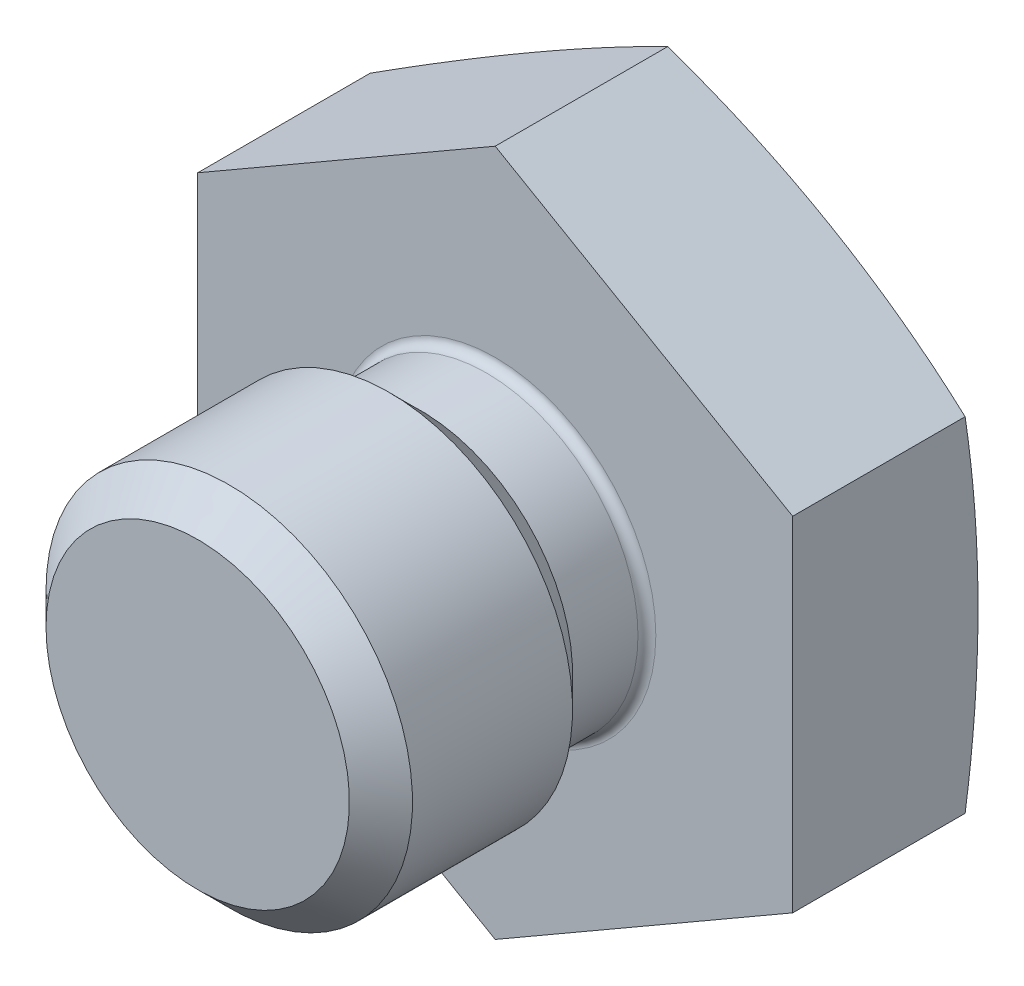
ISO-10303-21;
HEADER;
FILE_DESCRIPTION(('STEP AP214'),'2;1');
FILE_NAME('part.step','',(''),(''),'','','');
FILE_SCHEMA(('AUTOMOTIVE_DESIGN { 1 0 10303 214 1 1 1 1 }'));
ENDSEC;
DATA;
#1=APPLICATION_CONTEXT('core data for automotive mechanical design processes');
#2=APPLICATION_PROTOCOL_DEFINITION('international standard','automotive_design',2000,#1);
#3=PRODUCT_CONTEXT('',#1,'mechanical');
#4=PRODUCT('Part','Part','',(#3));
#5=PRODUCT_RELATED_PRODUCT_CATEGORY('part','',(#4));
#6=PRODUCT_DEFINITION_FORMATION('','',#4);
#7=PRODUCT_DEFINITION_CONTEXT('part definition',#1,'design');
#8=PRODUCT_DEFINITION('design','',#6,#7);
#9=PRODUCT_DEFINITION_SHAPE('','',#8);
#10=(LENGTH_UNIT() NAMED_UNIT(*) SI_UNIT(.MILLI.,.METRE.));
#11=(NAMED_UNIT(*) PLANE_ANGLE_UNIT() SI_UNIT($,.RADIAN.));
#12=(NAMED_UNIT(*) SI_UNIT($,.STERADIAN.) SOLID_ANGLE_UNIT());
#13=UNCERTAINTY_MEASURE_WITH_UNIT(LENGTH_MEASURE(1.E-05),#10,'distance_accuracy_value','');
#14=(GEOMETRIC_REPRESENTATION_CONTEXT(3) GLOBAL_UNCERTAINTY_ASSIGNED_CONTEXT((#13)) GLOBAL_UNIT_ASSIGNED_CONTEXT((#10,
#11,#12)) REPRESENTATION_CONTEXT('',''));
#15=CARTESIAN_POINT('',(0.,0.,0.));
#16=DIRECTION('',(0.,0.,1.));
#17=DIRECTION('',(1.,0.,0.));
#18=AXIS2_PLACEMENT_3D('',#15,#16,#17);
#19=CARTESIAN_POINT('',(0.,29.614428493557,0.));
#20=DIRECTION('',(0.,0.,1.));
#21=DIRECTION('',(1.,0.,0.));
#22=AXIS2_PLACEMENT_3D('',#19,#20,#21);
#23=PLANE('',#22);
#24=CARTESIAN_POINT('',(0.,0.,0.));
#25=DIRECTION('',(0.,0.,1.));
#26=DIRECTION('',(1.,0.,0.));
#27=AXIS2_PLACEMENT_3D('',#24,#25,#26);
#28=CIRCLE('',#27,6.858);
#29=CARTESIAN_POINT('',(6.858,0.,0.));
#30=VERTEX_POINT('',#29);
#31=EDGE_CURVE('E42',#30,#30,#28,.F.);
#32=ORIENTED_EDGE('',*,*,#31,.T.);
#33=EDGE_LOOP('',(#32));
#34=FACE_BOUND('',#33,.T.);
#35=DIRECTION('',(0.,1.,0.));
#36=VECTOR('',#35,1.);
#37=CARTESIAN_POINT('',(12.7,-7.33234841870825,0.));
#38=LINE('',#37,#36);
#39=CARTESIAN_POINT('',(12.7,-7.33234841870825,0.));
#40=VERTEX_POINT('',#39);
#41=CARTESIAN_POINT('',(12.7,7.33234841870826,0.));
#42=VERTEX_POINT('',#41);
#43=EDGE_CURVE('E115',#40,#42,#38,.T.);
#44=ORIENTED_EDGE('',*,*,#43,.T.);
#45=DIRECTION('',(-0.866025403784439,0.5,0.));
#46=VECTOR('',#45,1.);
#47=CARTESIAN_POINT('',(12.7,7.33234841870826,0.));
#48=LINE('',#47,#46);
#49=CARTESIAN_POINT('',(0.,14.6646968374165,0.));
#50=VERTEX_POINT('',#49);
#51=EDGE_CURVE('E110',#42,#50,#48,.T.);
#52=ORIENTED_EDGE('',*,*,#51,.T.);
#53=DIRECTION('',(-0.866025403784439,-0.5,0.));
#54=VECTOR('',#53,1.);
#55=CARTESIAN_POINT('',(0.,14.6646968374165,0.));
#56=LINE('',#55,#54);
#57=CARTESIAN_POINT('',(-12.7,7.33234841870826,0.));
#58=VERTEX_POINT('',#57);
#59=EDGE_CURVE('E108',#50,#58,#56,.T.);
#60=ORIENTED_EDGE('',*,*,#59,.T.);
#61=DIRECTION('',(0.,-1.,0.));
#62=VECTOR('',#61,1.);
#63=CARTESIAN_POINT('',(-12.7,7.33234841870825,0.));
#64=LINE('',#63,#62);
#65=CARTESIAN_POINT('',(-12.7,-7.33234841870825,0.));
#66=VERTEX_POINT('',#65);
#67=EDGE_CURVE('E57',#58,#66,#64,.T.);
#68=ORIENTED_EDGE('',*,*,#67,.T.);
#69=DIRECTION('',(0.866025403784438,-0.5,0.));
#70=VECTOR('',#69,1.);
#71=CARTESIAN_POINT('',(-12.7,-7.33234841870825,0.));
#72=LINE('',#71,#70);
#73=CARTESIAN_POINT('',(0.,-14.6646968374165,0.));
#74=VERTEX_POINT('',#73);
#75=EDGE_CURVE('E97',#66,#74,#72,.T.);
#76=ORIENTED_EDGE('',*,*,#75,.T.);
#77=DIRECTION('',(0.866025403784439,0.5,0.));
#78=VECTOR('',#77,1.);
#79=CARTESIAN_POINT('',(0.,-14.6646968374165,0.));
#80=LINE('',#79,#78);
#81=EDGE_CURVE('E103',#74,#40,#80,.T.);
#82=ORIENTED_EDGE('',*,*,#81,.T.);
#83=EDGE_LOOP('',(#44,#52,#60,#68,#76,#82));
#84=FACE_BOUND('',#83,.T.);
#85=ADVANCED_FACE('F34',(#34,#84),#23,.T.);
#86=CARTESIAN_POINT('',(0.,0.,0.));
#87=DIRECTION('',(0.,0.,-1.));
#88=DIRECTION('',(-1.,0.,0.));
#89=AXIS2_PLACEMENT_3D('',#86,#87,#88);
#90=CYLINDRICAL_SURFACE('',#89,6.477);
#91=CARTESIAN_POINT('',(0.,0.,0.380999999999999));
#92=DIRECTION('',(0.,0.,1.));
#93=DIRECTION('',(1.,0.,0.));
#94=AXIS2_PLACEMENT_3D('',#91,#92,#93);
#95=CIRCLE('',#94,6.477);
#96=CARTESIAN_POINT('',(6.477,0.,0.380999999999999));
#97=VERTEX_POINT('',#96);
#98=EDGE_CURVE('E12',#97,#97,#95,.T.);
#99=ORIENTED_EDGE('',*,*,#98,.T.);
#100=EDGE_LOOP('',(#99));
#101=FACE_BOUND('',#100,.T.);
#102=CARTESIAN_POINT('',(0.,0.,3.175));
#103=DIRECTION('',(0.,0.,-1.));
#104=DIRECTION('',(-1.,0.,0.));
#105=AXIS2_PLACEMENT_3D('',#102,#103,#104);
#106=CIRCLE('',#105,6.477);
#107=CARTESIAN_POINT('',(-6.477,0.,3.175));
#108=VERTEX_POINT('',#107);
#109=EDGE_CURVE('E148',#108,#108,#106,.T.);
#110=ORIENTED_EDGE('',*,*,#109,.T.);
#111=EDGE_LOOP('',(#110));
#112=FACE_BOUND('',#111,.T.);
#113=ADVANCED_FACE('F165',(#101,#112),#90,.T.);
#114=CARTESIAN_POINT('',(0.,0.,3.175));
#115=DIRECTION('',(0.,0.,1.));
#116=DIRECTION('',(1.,0.,0.));
#117=AXIS2_PLACEMENT_3D('',#114,#115,#116);
#118=CONICAL_SURFACE('',#117,6.477,0.785398163397447);
#119=CARTESIAN_POINT('',(0.,0.,4.5212));
#120=DIRECTION('',(0.,0.,-1.));
#121=DIRECTION('',(-1.,0.,0.));
#122=AXIS2_PLACEMENT_3D('',#119,#120,#121);
#123=CIRCLE('',#122,7.8232);
#124=CARTESIAN_POINT('',(-7.8232,0.,4.5212));
#125=VERTEX_POINT('',#124);
#126=EDGE_CURVE('E145',#125,#125,#123,.T.);
#127=ORIENTED_EDGE('',*,*,#126,.T.);
#128=EDGE_LOOP('',(#127));
#129=FACE_BOUND('',#128,.T.);
#130=ORIENTED_EDGE('',*,*,#109,.F.);
#131=EDGE_LOOP('',(#130));
#132=FACE_BOUND('',#131,.T.);
#133=ADVANCED_FACE('F170',(#129,#132),#118,.T.);
#134=CARTESIAN_POINT('',(0.,0.,0.));
#135=DIRECTION('',(0.,0.,-1.));
#136=DIRECTION('',(-1.,0.,0.));
#137=AXIS2_PLACEMENT_3D('',#134,#135,#136);
#138=CYLINDRICAL_SURFACE('',#137,7.8232);
#139=CARTESIAN_POINT('',(0.,0.,11.3538));
#140=DIRECTION('',(0.,0.,-1.));
#141=DIRECTION('',(-1.,0.,0.));
#142=AXIS2_PLACEMENT_3D('',#139,#140,#141);
#143=CIRCLE('',#142,7.8232);
#144=CARTESIAN_POINT('',(-7.8232,0.,11.3538));
#145=VERTEX_POINT('',#144);
#146=EDGE_CURVE('E142',#145,#145,#143,.T.);
#147=ORIENTED_EDGE('',*,*,#146,.T.);
#148=EDGE_LOOP('',(#147));
#149=FACE_BOUND('',#148,.T.);
#150=ORIENTED_EDGE('',*,*,#126,.F.);
#151=EDGE_LOOP('',(#150));
#152=FACE_BOUND('',#151,.T.);
#153=ADVANCED_FACE('F183',(#149,#152),#138,.T.);
#154=CARTESIAN_POINT('',(0.,0.,11.3538));
#155=DIRECTION('',(0.,0.,-1.));
#156=DIRECTION('',(-1.,0.,0.));
#157=AXIS2_PLACEMENT_3D('',#154,#155,#156);
#158=CONICAL_SURFACE('',#157,7.8232,0.785398163397451);
#159=CARTESIAN_POINT('',(0.,0.,12.7));
#160=DIRECTION('',(0.,0.,-1.));
#161=DIRECTION('',(-1.,0.,0.));
#162=AXIS2_PLACEMENT_3D('',#159,#160,#161);
#163=CIRCLE('',#162,6.477);
#164=CARTESIAN_POINT('',(-6.477,0.,12.7));
#165=VERTEX_POINT('',#164);
#166=EDGE_CURVE('E139',#165,#165,#163,.T.);
#167=ORIENTED_EDGE('',*,*,#166,.T.);
#168=EDGE_LOOP('',(#167));
#169=FACE_BOUND('',#168,.T.);
#170=ORIENTED_EDGE('',*,*,#146,.F.);
#171=EDGE_LOOP('',(#170));
#172=FACE_BOUND('',#171,.T.);
#173=ADVANCED_FACE('F179',(#169,#172),#158,.T.);
#174=CARTESIAN_POINT('',(0.,6.477,12.7));
#175=DIRECTION('',(0.,0.,1.));
#176=DIRECTION('',(1.,0.,0.));
#177=AXIS2_PLACEMENT_3D('',#174,#175,#176);
#178=PLANE('',#177);
#179=ORIENTED_EDGE('',*,*,#166,.F.);
#180=EDGE_LOOP('',(#179));
#181=FACE_BOUND('',#180,.T.);
#182=ADVANCED_FACE('F176',(#181),#178,.T.);
#183=CARTESIAN_POINT('',(12.7,7.33234841870826,-9.52500000000001));
#184=DIRECTION('',(0.5,0.866025403784438,0.));
#185=DIRECTION('',(-0.866025403784439,0.5,0.));
#186=AXIS2_PLACEMENT_3D('',#183,#184,#185);
#187=PLANE('',#186);
#188=DIRECTION('',(0.,0.,1.));
#189=VECTOR('',#188,1.);
#190=CARTESIAN_POINT('',(0.,14.6646968374165,-9.52500000000001));
#191=LINE('',#190,#189);
#192=CARTESIAN_POINT('',(0.,14.6646968374165,-7.36229707402198));
#193=VERTEX_POINT('',#192);
#194=EDGE_CURVE('E49',#193,#50,#191,.T.);
#195=ORIENTED_EDGE('',*,*,#194,.T.);
#196=ORIENTED_EDGE('',*,*,#51,.F.);
#197=DIRECTION('',(0.,0.,1.));
#198=VECTOR('',#197,1.);
#199=CARTESIAN_POINT('',(12.7,7.33234841870826,-9.52500000000001));
#200=LINE('',#199,#198);
#201=CARTESIAN_POINT('',(12.7,7.33234841870826,-7.36229707402198));
#202=VERTEX_POINT('',#201);
#203=EDGE_CURVE('E117',#202,#42,#200,.T.);
#204=ORIENTED_EDGE('',*,*,#203,.F.);
#205=CARTESIAN_POINT('',(6.35,10.9985226280624,41.275));
#206=DIRECTION('',(0.5,0.866025403784438,0.));
#207=DIRECTION('',(-0.866025403784439,0.5,0.));
#208=AXIS2_PLACEMENT_3D('',#205,#206,#207);
#209=CIRCLE('',#208,49.1868884968342);
#210=EDGE_CURVE('E136',#193,#202,#209,.F.);
#211=ORIENTED_EDGE('',*,*,#210,.F.);
#212=EDGE_LOOP('',(#195,#196,#204,#211));
#213=FACE_BOUND('',#212,.T.);
#214=ADVANCED_FACE('F173',(#213),#187,.T.);
#215=CARTESIAN_POINT('',(12.7,-7.33234841870825,-9.52500000000001));
#216=DIRECTION('',(1.,0.,0.));
#217=DIRECTION('',(0.,0.,-1.));
#218=AXIS2_PLACEMENT_3D('',#215,#216,#217);
#219=PLANE('',#218);
#220=ORIENTED_EDGE('',*,*,#203,.T.);
#221=ORIENTED_EDGE('',*,*,#43,.F.);
#222=DIRECTION('',(0.,0.,1.));
#223=VECTOR('',#222,1.);
#224=CARTESIAN_POINT('',(12.7,-7.33234841870825,-9.52500000000001));
#225=LINE('',#224,#223);
#226=CARTESIAN_POINT('',(12.7,-7.33234841870826,-7.36229707402199));
#227=VERTEX_POINT('',#226);
#228=EDGE_CURVE('E120',#227,#40,#225,.T.);
#229=ORIENTED_EDGE('',*,*,#228,.F.);
#230=CARTESIAN_POINT('',(12.7,0.,41.275));
#231=DIRECTION('',(1.,0.,0.));
#232=DIRECTION('',(0.,0.,-1.));
#233=AXIS2_PLACEMENT_3D('',#230,#231,#232);
#234=CIRCLE('',#233,49.1868884968342);
#235=EDGE_CURVE('E133',#202,#227,#234,.F.);
#236=ORIENTED_EDGE('',*,*,#235,.F.);
#237=EDGE_LOOP('',(#220,#221,#229,#236));
#238=FACE_BOUND('',#237,.T.);
#239=ADVANCED_FACE('F217',(#238),#219,.T.);
#240=CARTESIAN_POINT('',(0.,-14.6646968374165,-9.52500000000001));
#241=DIRECTION('',(0.5,-0.866025403784439,0.));
#242=DIRECTION('',(0.866025403784439,0.5,0.));
#243=AXIS2_PLACEMENT_3D('',#240,#241,#242);
#244=PLANE('',#243);
#245=ORIENTED_EDGE('',*,*,#228,.T.);
#246=ORIENTED_EDGE('',*,*,#81,.F.);
#247=DIRECTION('',(0.,0.,1.));
#248=VECTOR('',#247,1.);
#249=CARTESIAN_POINT('',(0.,-14.6646968374165,-9.52500000000001));
#250=LINE('',#249,#248);
#251=CARTESIAN_POINT('',(0.,-14.6646968374165,-7.36229707402198));
#252=VERTEX_POINT('',#251);
#253=EDGE_CURVE('E93',#252,#74,#250,.T.);
#254=ORIENTED_EDGE('',*,*,#253,.F.);
#255=CARTESIAN_POINT('',(6.34999999999999,-10.9985226280624,41.275));
#256=DIRECTION('',(0.5,-0.866025403784439,0.));
#257=DIRECTION('',(0.866025403784439,0.5,0.));
#258=AXIS2_PLACEMENT_3D('',#255,#256,#257);
#259=CIRCLE('',#258,49.1868884968342);
#260=EDGE_CURVE('E130',#227,#252,#259,.F.);
#261=ORIENTED_EDGE('',*,*,#260,.F.);
#262=EDGE_LOOP('',(#245,#246,#254,#261));
#263=FACE_BOUND('',#262,.T.);
#264=ADVANCED_FACE('F224',(#263),#244,.T.);
#265=CARTESIAN_POINT('',(-12.7,-7.33234841870825,-9.52500000000001));
#266=DIRECTION('',(-0.5,-0.866025403784439,0.));
#267=DIRECTION('',(0.866025403784439,-0.5,0.));
#268=AXIS2_PLACEMENT_3D('',#265,#266,#267);
#269=PLANE('',#268);
#270=ORIENTED_EDGE('',*,*,#253,.T.);
#271=ORIENTED_EDGE('',*,*,#75,.F.);
#272=DIRECTION('',(0.,0.,1.));
#273=VECTOR('',#272,1.);
#274=CARTESIAN_POINT('',(-12.7,-7.33234841870825,-9.52500000000001));
#275=LINE('',#274,#273);
#276=CARTESIAN_POINT('',(-12.7,-7.33234841870825,-7.36229707402198));
#277=VERTEX_POINT('',#276);
#278=EDGE_CURVE('E86',#277,#66,#275,.T.);
#279=ORIENTED_EDGE('',*,*,#278,.F.);
#280=CARTESIAN_POINT('',(-6.35,-10.9985226280624,41.275));
#281=DIRECTION('',(-0.5,-0.866025403784439,0.));
#282=DIRECTION('',(0.866025403784439,-0.5,0.));
#283=AXIS2_PLACEMENT_3D('',#280,#281,#282);
#284=CIRCLE('',#283,49.1868884968342);
#285=EDGE_CURVE('E128',#252,#277,#284,.F.);
#286=ORIENTED_EDGE('',*,*,#285,.F.);
#287=EDGE_LOOP('',(#270,#271,#279,#286));
#288=FACE_BOUND('',#287,.T.);
#289=ADVANCED_FACE('F98',(#288),#269,.T.);
#290=CARTESIAN_POINT('',(-12.7,7.33234841870825,-9.52500000000001));
#291=DIRECTION('',(-1.,0.,0.));
#292=DIRECTION('',(0.,0.,1.));
#293=AXIS2_PLACEMENT_3D('',#290,#291,#292);
#294=PLANE('',#293);
#295=ORIENTED_EDGE('',*,*,#278,.T.);
#296=ORIENTED_EDGE('',*,*,#67,.F.);
#297=DIRECTION('',(0.,0.,1.));
#298=VECTOR('',#297,1.);
#299=CARTESIAN_POINT('',(-12.7,7.33234841870825,-9.52500000000001));
#300=LINE('',#299,#298);
#301=CARTESIAN_POINT('',(-12.7,7.33234841870825,-7.36229707402198));
#302=VERTEX_POINT('',#301);
#303=EDGE_CURVE('E94',#302,#58,#300,.T.);
#304=ORIENTED_EDGE('',*,*,#303,.F.);
#305=CARTESIAN_POINT('',(-12.7,0.,41.275));
#306=DIRECTION('',(-1.,0.,0.));
#307=DIRECTION('',(0.,0.,1.));
#308=AXIS2_PLACEMENT_3D('',#305,#306,#307);
#309=CIRCLE('',#308,49.1868884968342);
#310=EDGE_CURVE('E90',#277,#302,#309,.F.);
#311=ORIENTED_EDGE('',*,*,#310,.F.);
#312=EDGE_LOOP('',(#295,#296,#304,#311));
#313=FACE_BOUND('',#312,.T.);
#314=ADVANCED_FACE('F88',(#313),#294,.T.);
#315=CARTESIAN_POINT('',(0.,14.6646968374165,-9.52500000000001));
#316=DIRECTION('',(-0.5,0.866025403784439,0.));
#317=DIRECTION('',(-0.866025403784439,-0.5,0.));
#318=AXIS2_PLACEMENT_3D('',#315,#316,#317);
#319=PLANE('',#318);
#320=ORIENTED_EDGE('',*,*,#303,.T.);
#321=ORIENTED_EDGE('',*,*,#59,.F.);
#322=ORIENTED_EDGE('',*,*,#194,.F.);
#323=CARTESIAN_POINT('',(-6.35,10.9985226280624,41.275));
#324=DIRECTION('',(-0.5,0.866025403784439,0.));
#325=DIRECTION('',(-0.866025403784439,-0.5,0.));
#326=AXIS2_PLACEMENT_3D('',#323,#324,#325);
#327=CIRCLE('',#326,49.1868884968342);
#328=EDGE_CURVE('E119',#302,#193,#327,.F.);
#329=ORIENTED_EDGE('',*,*,#328,.F.);
#330=EDGE_LOOP('',(#320,#321,#322,#329));
#331=FACE_BOUND('',#330,.T.);
#332=ADVANCED_FACE('F160',(#331),#319,.T.);
#333=CARTESIAN_POINT('',(0.,0.,41.275));
#334=DIRECTION('',(0.,0.,-1.));
#335=DIRECTION('',(0.,1.,0.));
#336=AXIS2_PLACEMENT_3D('',#333,#334,#335);
#337=SPHERICAL_SURFACE('',#336,50.8);
#338=ORIENTED_EDGE('',*,*,#328,.T.);
#339=ORIENTED_EDGE('',*,*,#210,.T.);
#340=ORIENTED_EDGE('',*,*,#235,.T.);
#341=ORIENTED_EDGE('',*,*,#260,.T.);
#342=ORIENTED_EDGE('',*,*,#285,.T.);
#343=ORIENTED_EDGE('',*,*,#310,.T.);
#344=EDGE_LOOP('',(#338,#339,#340,#341,#342,#343));
#345=FACE_BOUND('',#344,.T.);
#346=ADVANCED_FACE('F155',(#345),#337,.T.);
#347=CARTESIAN_POINT('',(0.,0.,0.380999999999999));
#348=DIRECTION('',(0.,0.,1.));
#349=DIRECTION('',(1.,0.,0.));
#350=AXIS2_PLACEMENT_3D('',#347,#348,#349);
#351=TOROIDAL_SURFACE('',#350,6.858,0.381);
#352=ORIENTED_EDGE('',*,*,#98,.F.);
#353=EDGE_LOOP('',(#352));
#354=FACE_BOUND('',#353,.T.);
#355=ORIENTED_EDGE('',*,*,#31,.F.);
#356=EDGE_LOOP('',(#355));
#357=FACE_BOUND('',#356,.T.);
#358=ADVANCED_FACE('F36',(#354,#357),#351,.F.);
#359=CLOSED_SHELL('',(#85,#113,#133,#153,#173,#182,#214,#239,#264,#289,#314,#332,#346,#358));
#360=MANIFOLD_SOLID_BREP('B2',#359);
#361=ADVANCED_BREP_SHAPE_REPRESENTATION('',(#18,#360),#14);
#362=SHAPE_DEFINITION_REPRESENTATION(#9,#361);
ENDSEC;
END-ISO-10303-21;
